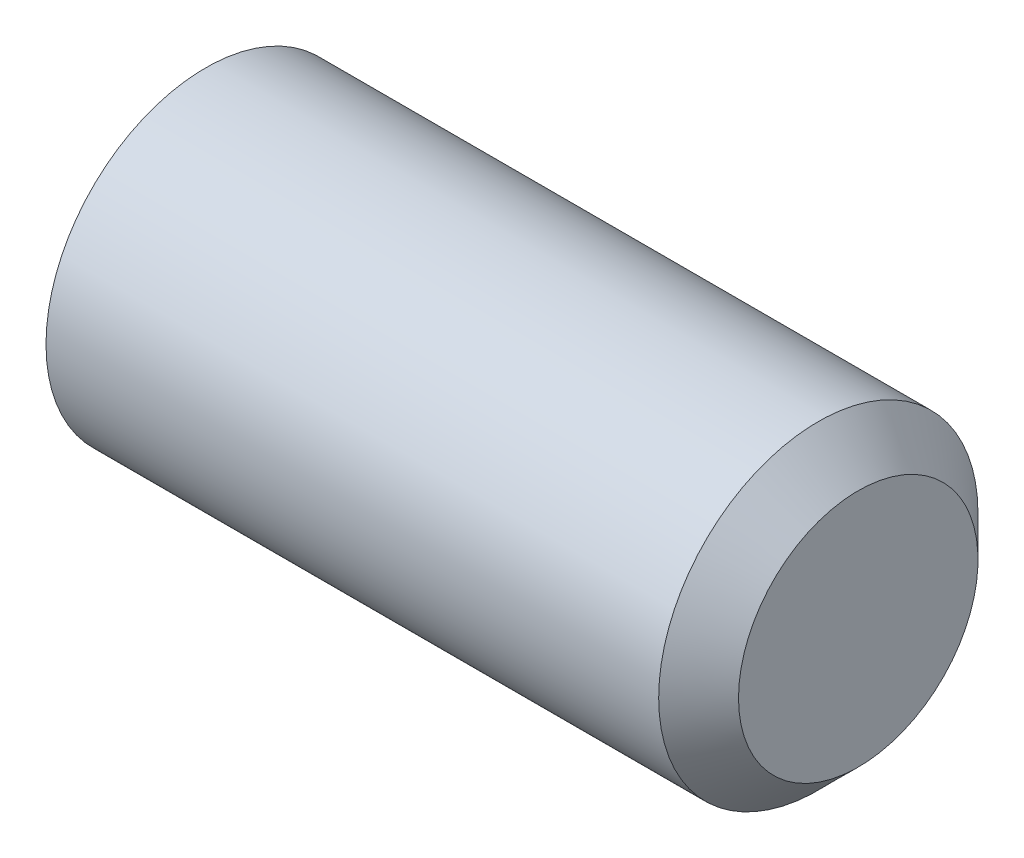
ISO-10303-21;
HEADER;
FILE_DESCRIPTION(('STEP AP214'),'2;1');
FILE_NAME('part.step','',(''),(''),'','','');
FILE_SCHEMA(('AUTOMOTIVE_DESIGN { 1 0 10303 214 1 1 1 1 }'));
ENDSEC;
DATA;
#1=APPLICATION_CONTEXT('core data for automotive mechanical design processes');
#2=APPLICATION_PROTOCOL_DEFINITION('international standard','automotive_design',2000,#1);
#3=PRODUCT_CONTEXT('',#1,'mechanical');
#4=PRODUCT('Part','Part','',(#3));
#5=PRODUCT_RELATED_PRODUCT_CATEGORY('part','',(#4));
#6=PRODUCT_DEFINITION_FORMATION('','',#4);
#7=PRODUCT_DEFINITION_CONTEXT('part definition',#1,'design');
#8=PRODUCT_DEFINITION('design','',#6,#7);
#9=PRODUCT_DEFINITION_SHAPE('','',#8);
#10=(LENGTH_UNIT() NAMED_UNIT(*) SI_UNIT(.MILLI.,.METRE.));
#11=(NAMED_UNIT(*) PLANE_ANGLE_UNIT() SI_UNIT($,.RADIAN.));
#12=(NAMED_UNIT(*) SI_UNIT($,.STERADIAN.) SOLID_ANGLE_UNIT());
#13=UNCERTAINTY_MEASURE_WITH_UNIT(LENGTH_MEASURE(1.E-05),#10,'distance_accuracy_value','');
#14=(GEOMETRIC_REPRESENTATION_CONTEXT(3) GLOBAL_UNCERTAINTY_ASSIGNED_CONTEXT((#13)) GLOBAL_UNIT_ASSIGNED_CONTEXT((#10,
#11,#12)) REPRESENTATION_CONTEXT('',''));
#15=CARTESIAN_POINT('',(0.,0.,0.));
#16=DIRECTION('',(0.,0.,1.));
#17=DIRECTION('',(1.,0.,0.));
#18=AXIS2_PLACEMENT_3D('',#15,#16,#17);
#19=CARTESIAN_POINT('',(0.,0.,0.));
#20=DIRECTION('',(-1.,0.,0.));
#21=DIRECTION('',(0.,0.,1.));
#22=AXIS2_PLACEMENT_3D('',#19,#20,#21);
#23=PLANE('',#22);
#24=CARTESIAN_POINT('',(0.,0.,0.));
#25=DIRECTION('',(-1.,0.,0.));
#26=DIRECTION('',(0.,0.,1.));
#27=AXIS2_PLACEMENT_3D('',#24,#25,#26);
#28=CIRCLE('',#27,10.352);
#29=CARTESIAN_POINT('',(0.,0.,10.352));
#30=VERTEX_POINT('',#29);
#31=EDGE_CURVE('E11',#30,#30,#28,.T.);
#32=ORIENTED_EDGE('',*,*,#31,.T.);
#33=EDGE_LOOP('',(#32));
#34=FACE_BOUND('',#33,.T.);
#35=DIRECTION('',(0.,0.,-1.));
#36=VECTOR('',#35,1.);
#37=CARTESIAN_POINT('',(0.,6.,3.46410161513775));
#38=LINE('',#37,#36);
#39=CARTESIAN_POINT('',(0.,6.,3.46410161513775));
#40=VERTEX_POINT('',#39);
#41=CARTESIAN_POINT('',(0.,6.,-3.46410161513776));
#42=VERTEX_POINT('',#41);
#43=EDGE_CURVE('E127',#40,#42,#38,.T.);
#44=ORIENTED_EDGE('',*,*,#43,.F.);
#45=DIRECTION('',(0.,-0.866025403784439,0.5));
#46=VECTOR('',#45,1.);
#47=CARTESIAN_POINT('',(0.,6.,3.46410161513775));
#48=LINE('',#47,#46);
#49=CARTESIAN_POINT('',(0.,0.,6.9282032302755));
#50=VERTEX_POINT('',#49);
#51=EDGE_CURVE('E49',#40,#50,#48,.T.);
#52=ORIENTED_EDGE('',*,*,#51,.T.);
#53=DIRECTION('',(0.,0.866025403784439,0.5));
#54=VECTOR('',#53,1.);
#55=CARTESIAN_POINT('',(0.,-5.99999999999999,3.46410161513775));
#56=LINE('',#55,#54);
#57=CARTESIAN_POINT('',(0.,-5.99999999999999,3.46410161513775));
#58=VERTEX_POINT('',#57);
#59=EDGE_CURVE('E118',#58,#50,#56,.T.);
#60=ORIENTED_EDGE('',*,*,#59,.F.);
#61=DIRECTION('',(0.,0.,-1.));
#62=VECTOR('',#61,1.);
#63=CARTESIAN_POINT('',(0.,-5.99999999999999,3.46410161513775));
#64=LINE('',#63,#62);
#65=CARTESIAN_POINT('',(0.,-5.99999999999999,-3.46410161513775));
#66=VERTEX_POINT('',#65);
#67=EDGE_CURVE('E121',#58,#66,#64,.T.);
#68=ORIENTED_EDGE('',*,*,#67,.T.);
#69=DIRECTION('',(0.,0.866025403784438,-0.5));
#70=VECTOR('',#69,1.);
#71=CARTESIAN_POINT('',(0.,-5.99999999999999,-3.46410161513775));
#72=LINE('',#71,#70);
#73=CARTESIAN_POINT('',(0.,0.,-6.92820323027551));
#74=VERTEX_POINT('',#73);
#75=EDGE_CURVE('E124',#66,#74,#72,.T.);
#76=ORIENTED_EDGE('',*,*,#75,.T.);
#77=DIRECTION('',(0.,-0.866025403784439,-0.5));
#78=VECTOR('',#77,1.);
#79=CARTESIAN_POINT('',(0.,6.,-3.46410161513776));
#80=LINE('',#79,#78);
#81=EDGE_CURVE('E107',#42,#74,#80,.T.);
#82=ORIENTED_EDGE('',*,*,#81,.F.);
#83=EDGE_LOOP('',(#44,#52,#60,#68,#76,#82));
#84=FACE_BOUND('',#83,.T.);
#85=ADVANCED_FACE('F35',(#34,#84),#23,.T.);
#86=CARTESIAN_POINT('',(0.,0.,0.));
#87=DIRECTION('',(1.,0.,0.));
#88=DIRECTION('',(0.,0.,-1.));
#89=AXIS2_PLACEMENT_3D('',#86,#87,#88);
#90=CONICAL_SURFACE('',#89,10.352,1.0471975511966);
#91=CARTESIAN_POINT('',(0.951473243624499,0.,0.));
#92=DIRECTION('',(-1.,0.,0.));
#93=DIRECTION('',(0.,0.,1.));
#94=AXIS2_PLACEMENT_3D('',#91,#92,#93);
#95=CIRCLE('',#94,12.);
#96=CARTESIAN_POINT('',(0.951473243624499,0.,12.));
#97=VERTEX_POINT('',#96);
#98=EDGE_CURVE('E42',#97,#97,#95,.T.);
#99=ORIENTED_EDGE('',*,*,#98,.T.);
#100=EDGE_LOOP('',(#99));
#101=FACE_BOUND('',#100,.T.);
#102=ORIENTED_EDGE('',*,*,#31,.F.);
#103=EDGE_LOOP('',(#102));
#104=FACE_BOUND('',#103,.T.);
#105=ADVANCED_FACE('F144',(#101,#104),#90,.T.);
#106=CARTESIAN_POINT('',(-12.7,0.,0.));
#107=DIRECTION('',(-1.,0.,0.));
#108=DIRECTION('',(0.,0.,1.));
#109=AXIS2_PLACEMENT_3D('',#106,#107,#108);
#110=CYLINDRICAL_SURFACE('',#109,12.);
#111=CARTESIAN_POINT('',(47.,0.,0.));
#112=DIRECTION('',(-1.,0.,0.));
#113=DIRECTION('',(0.,0.,1.));
#114=AXIS2_PLACEMENT_3D('',#111,#112,#113);
#115=CIRCLE('',#114,12.);
#116=CARTESIAN_POINT('',(47.,0.,12.));
#117=VERTEX_POINT('',#116);
#118=EDGE_CURVE('E139',#117,#117,#115,.T.);
#119=ORIENTED_EDGE('',*,*,#118,.T.);
#120=EDGE_LOOP('',(#119));
#121=FACE_BOUND('',#120,.T.);
#122=ORIENTED_EDGE('',*,*,#98,.F.);
#123=EDGE_LOOP('',(#122));
#124=FACE_BOUND('',#123,.T.);
#125=ADVANCED_FACE('F147',(#121,#124),#110,.T.);
#126=CARTESIAN_POINT('',(47.,0.,0.));
#127=DIRECTION('',(-1.,0.,0.));
#128=DIRECTION('',(0.,0.,1.));
#129=AXIS2_PLACEMENT_3D('',#126,#127,#128);
#130=CONICAL_SURFACE('',#129,12.,0.785398163397447);
#131=CARTESIAN_POINT('',(50.,0.,0.));
#132=DIRECTION('',(-1.,0.,0.));
#133=DIRECTION('',(0.,0.,1.));
#134=AXIS2_PLACEMENT_3D('',#131,#132,#133);
#135=CIRCLE('',#134,9.);
#136=CARTESIAN_POINT('',(50.,0.,9.));
#137=VERTEX_POINT('',#136);
#138=EDGE_CURVE('E136',#137,#137,#135,.T.);
#139=ORIENTED_EDGE('',*,*,#138,.T.);
#140=EDGE_LOOP('',(#139));
#141=FACE_BOUND('',#140,.T.);
#142=ORIENTED_EDGE('',*,*,#118,.F.);
#143=EDGE_LOOP('',(#142));
#144=FACE_BOUND('',#143,.T.);
#145=ADVANCED_FACE('F149',(#141,#144),#130,.T.);
#146=CARTESIAN_POINT('',(50.,9.,0.));
#147=DIRECTION('',(1.,0.,0.));
#148=DIRECTION('',(0.,0.,-1.));
#149=AXIS2_PLACEMENT_3D('',#146,#147,#148);
#150=PLANE('',#149);
#151=ORIENTED_EDGE('',*,*,#138,.F.);
#152=EDGE_LOOP('',(#151));
#153=FACE_BOUND('',#152,.T.);
#154=ADVANCED_FACE('F156',(#153),#150,.T.);
#155=CARTESIAN_POINT('',(15.,6.,3.46410161513775));
#156=DIRECTION('',(0.,-0.5,-0.866025403784439));
#157=DIRECTION('',(0.,0.866025403784439,-0.5));
#158=AXIS2_PLACEMENT_3D('',#155,#156,#157);
#159=PLANE('',#158);
#160=ORIENTED_EDGE('',*,*,#51,.F.);
#161=DIRECTION('',(-1.,0.,0.));
#162=VECTOR('',#161,1.);
#163=CARTESIAN_POINT('',(15.,6.,3.46410161513775));
#164=LINE('',#163,#162);
#165=CARTESIAN_POINT('',(15.,6.,3.46410161513775));
#166=VERTEX_POINT('',#165);
#167=EDGE_CURVE('E54',#166,#40,#164,.T.);
#168=ORIENTED_EDGE('',*,*,#167,.F.);
#169=DIRECTION('',(0.,-0.866025403784439,0.5));
#170=VECTOR('',#169,1.);
#171=CARTESIAN_POINT('',(15.,6.,3.46410161513775));
#172=LINE('',#171,#170);
#173=CARTESIAN_POINT('',(15.,0.,6.9282032302755));
#174=VERTEX_POINT('',#173);
#175=EDGE_CURVE('E81',#166,#174,#172,.T.);
#176=ORIENTED_EDGE('',*,*,#175,.T.);
#177=DIRECTION('',(-1.,0.,0.));
#178=VECTOR('',#177,1.);
#179=CARTESIAN_POINT('',(15.,0.,6.9282032302755));
#180=LINE('',#179,#178);
#181=EDGE_CURVE('E134',#174,#50,#180,.T.);
#182=ORIENTED_EDGE('',*,*,#181,.T.);
#183=EDGE_LOOP('',(#160,#168,#176,#182));
#184=FACE_BOUND('',#183,.T.);
#185=ADVANCED_FACE('F187',(#184),#159,.T.);
#186=CARTESIAN_POINT('',(15.,-5.99999999999999,3.46410161513775));
#187=DIRECTION('',(0.,-0.5,0.866025403784439));
#188=DIRECTION('',(0.,-0.866025403784439,-0.5));
#189=AXIS2_PLACEMENT_3D('',#186,#187,#188);
#190=PLANE('',#189);
#191=ORIENTED_EDGE('',*,*,#59,.T.);
#192=ORIENTED_EDGE('',*,*,#181,.F.);
#193=DIRECTION('',(0.,0.866025403784439,0.5));
#194=VECTOR('',#193,1.);
#195=CARTESIAN_POINT('',(15.,-5.99999999999999,3.46410161513775));
#196=LINE('',#195,#194);
#197=CARTESIAN_POINT('',(15.,-5.99999999999999,3.46410161513775));
#198=VERTEX_POINT('',#197);
#199=EDGE_CURVE('E267',#198,#174,#196,.T.);
#200=ORIENTED_EDGE('',*,*,#199,.F.);
#201=DIRECTION('',(-1.,0.,0.));
#202=VECTOR('',#201,1.);
#203=CARTESIAN_POINT('',(15.,-5.99999999999999,3.46410161513775));
#204=LINE('',#203,#202);
#205=EDGE_CURVE('E132',#198,#58,#204,.T.);
#206=ORIENTED_EDGE('',*,*,#205,.T.);
#207=EDGE_LOOP('',(#191,#192,#200,#206));
#208=FACE_BOUND('',#207,.T.);
#209=ADVANCED_FACE('F183',(#208),#190,.F.);
#210=CARTESIAN_POINT('',(15.,-5.99999999999999,3.46410161513775));
#211=DIRECTION('',(0.,1.,0.));
#212=DIRECTION('',(0.,0.,1.));
#213=AXIS2_PLACEMENT_3D('',#210,#211,#212);
#214=PLANE('',#213);
#215=ORIENTED_EDGE('',*,*,#67,.F.);
#216=ORIENTED_EDGE('',*,*,#205,.F.);
#217=DIRECTION('',(0.,0.,-1.));
#218=VECTOR('',#217,1.);
#219=CARTESIAN_POINT('',(15.,-5.99999999999999,3.46410161513775));
#220=LINE('',#219,#218);
#221=CARTESIAN_POINT('',(15.,-5.99999999999999,-3.46410161513775));
#222=VERTEX_POINT('',#221);
#223=EDGE_CURVE('E102',#198,#222,#220,.T.);
#224=ORIENTED_EDGE('',*,*,#223,.T.);
#225=DIRECTION('',(-1.,0.,0.));
#226=VECTOR('',#225,1.);
#227=CARTESIAN_POINT('',(15.,-5.99999999999999,-3.46410161513775));
#228=LINE('',#227,#226);
#229=EDGE_CURVE('E97',#222,#66,#228,.T.);
#230=ORIENTED_EDGE('',*,*,#229,.T.);
#231=EDGE_LOOP('',(#215,#216,#224,#230));
#232=FACE_BOUND('',#231,.T.);
#233=ADVANCED_FACE('F180',(#232),#214,.T.);
#234=CARTESIAN_POINT('',(15.,-5.99999999999999,-3.46410161513775));
#235=DIRECTION('',(0.,0.5,0.866025403784438));
#236=DIRECTION('',(0.,-0.866025403784438,0.5));
#237=AXIS2_PLACEMENT_3D('',#234,#235,#236);
#238=PLANE('',#237);
#239=ORIENTED_EDGE('',*,*,#75,.F.);
#240=ORIENTED_EDGE('',*,*,#229,.F.);
#241=DIRECTION('',(0.,0.866025403784438,-0.5));
#242=VECTOR('',#241,1.);
#243=CARTESIAN_POINT('',(15.,-5.99999999999999,-3.46410161513775));
#244=LINE('',#243,#242);
#245=CARTESIAN_POINT('',(15.,0.,-6.92820323027551));
#246=VERTEX_POINT('',#245);
#247=EDGE_CURVE('E92',#222,#246,#244,.T.);
#248=ORIENTED_EDGE('',*,*,#247,.T.);
#249=DIRECTION('',(-1.,0.,0.));
#250=VECTOR('',#249,1.);
#251=CARTESIAN_POINT('',(15.,0.,-6.92820323027551));
#252=LINE('',#251,#250);
#253=EDGE_CURVE('E96',#246,#74,#252,.T.);
#254=ORIENTED_EDGE('',*,*,#253,.T.);
#255=EDGE_LOOP('',(#239,#240,#248,#254));
#256=FACE_BOUND('',#255,.T.);
#257=ADVANCED_FACE('F95',(#256),#238,.T.);
#258=CARTESIAN_POINT('',(15.,6.,-3.46410161513776));
#259=DIRECTION('',(0.,0.5,-0.866025403784438));
#260=DIRECTION('',(0.,0.866025403784439,0.5));
#261=AXIS2_PLACEMENT_3D('',#258,#259,#260);
#262=PLANE('',#261);
#263=ORIENTED_EDGE('',*,*,#81,.T.);
#264=ORIENTED_EDGE('',*,*,#253,.F.);
#265=DIRECTION('',(0.,-0.866025403784439,-0.5));
#266=VECTOR('',#265,1.);
#267=CARTESIAN_POINT('',(15.,6.,-3.46410161513776));
#268=LINE('',#267,#266);
#269=CARTESIAN_POINT('',(15.,6.,-3.46410161513776));
#270=VERTEX_POINT('',#269);
#271=EDGE_CURVE('E101',#270,#246,#268,.T.);
#272=ORIENTED_EDGE('',*,*,#271,.F.);
#273=DIRECTION('',(-1.,0.,0.));
#274=VECTOR('',#273,1.);
#275=CARTESIAN_POINT('',(15.,6.,-3.46410161513776));
#276=LINE('',#275,#274);
#277=EDGE_CURVE('E77',#270,#42,#276,.T.);
#278=ORIENTED_EDGE('',*,*,#277,.T.);
#279=EDGE_LOOP('',(#263,#264,#272,#278));
#280=FACE_BOUND('',#279,.T.);
#281=ADVANCED_FACE('F104',(#280),#262,.F.);
#282=CARTESIAN_POINT('',(15.,6.,3.46410161513775));
#283=DIRECTION('',(0.,1.,0.));
#284=DIRECTION('',(0.,0.,1.));
#285=AXIS2_PLACEMENT_3D('',#282,#283,#284);
#286=PLANE('',#285);
#287=ORIENTED_EDGE('',*,*,#43,.T.);
#288=ORIENTED_EDGE('',*,*,#277,.F.);
#289=DIRECTION('',(0.,0.,-1.));
#290=VECTOR('',#289,1.);
#291=CARTESIAN_POINT('',(15.,6.,3.46410161513775));
#292=LINE('',#291,#290);
#293=EDGE_CURVE('E112',#166,#270,#292,.T.);
#294=ORIENTED_EDGE('',*,*,#293,.F.);
#295=ORIENTED_EDGE('',*,*,#167,.T.);
#296=EDGE_LOOP('',(#287,#288,#294,#295));
#297=FACE_BOUND('',#296,.T.);
#298=ADVANCED_FACE('F168',(#297),#286,.F.);
#299=CARTESIAN_POINT('',(15.,12.,0.));
#300=DIRECTION('',(1.,0.,0.));
#301=DIRECTION('',(0.,0.,-1.));
#302=AXIS2_PLACEMENT_3D('',#299,#300,#301);
#303=PLANE('',#302);
#304=ORIENTED_EDGE('',*,*,#175,.F.);
#305=ORIENTED_EDGE('',*,*,#293,.T.);
#306=ORIENTED_EDGE('',*,*,#271,.T.);
#307=ORIENTED_EDGE('',*,*,#247,.F.);
#308=ORIENTED_EDGE('',*,*,#223,.F.);
#309=ORIENTED_EDGE('',*,*,#199,.T.);
#310=EDGE_LOOP('',(#304,#305,#306,#307,#308,#309));
#311=FACE_BOUND('',#310,.T.);
#312=ADVANCED_FACE('F110',(#311),#303,.F.);
#313=CLOSED_SHELL('',(#85,#105,#125,#145,#154,#185,#209,#233,#257,#281,#298,#312));
#314=MANIFOLD_SOLID_BREP('B2',#313);
#315=ADVANCED_BREP_SHAPE_REPRESENTATION('',(#18,#314),#14);
#316=SHAPE_DEFINITION_REPRESENTATION(#9,#315);
ENDSEC;
END-ISO-10303-21;
